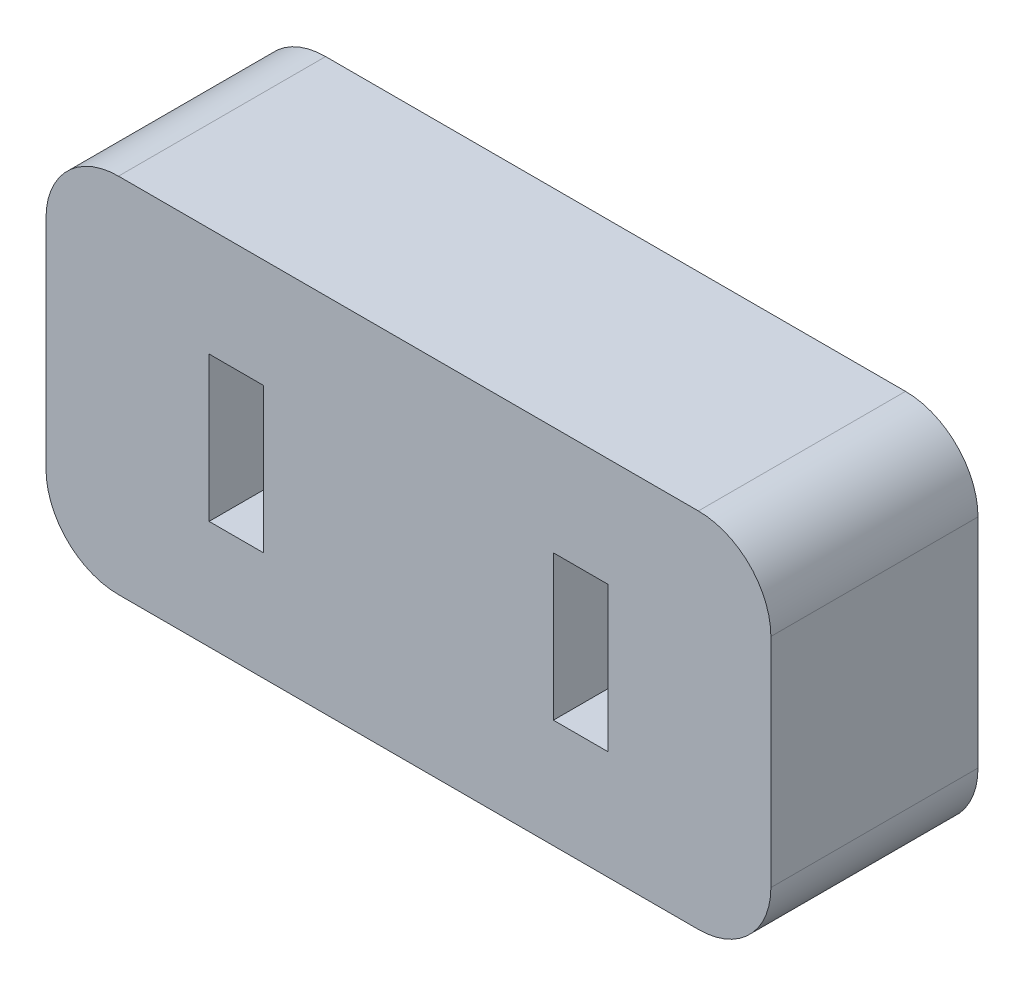
ISO-10303-21;
HEADER;
FILE_DESCRIPTION(('STEP AP214'),'2;1');
FILE_NAME('part.step','',(''),(''),'','','');
FILE_SCHEMA(('AUTOMOTIVE_DESIGN { 1 0 10303 214 1 1 1 1 }'));
ENDSEC;
DATA;
#1=APPLICATION_CONTEXT('core data for automotive mechanical design processes');
#2=APPLICATION_PROTOCOL_DEFINITION('international standard','automotive_design',2000,#1);
#3=PRODUCT_CONTEXT('',#1,'mechanical');
#4=PRODUCT('Part','Part','',(#3));
#5=PRODUCT_RELATED_PRODUCT_CATEGORY('part','',(#4));
#6=PRODUCT_DEFINITION_FORMATION('','',#4);
#7=PRODUCT_DEFINITION_CONTEXT('part definition',#1,'design');
#8=PRODUCT_DEFINITION('design','',#6,#7);
#9=PRODUCT_DEFINITION_SHAPE('','',#8);
#10=(LENGTH_UNIT() NAMED_UNIT(*) SI_UNIT(.MILLI.,.METRE.));
#11=(NAMED_UNIT(*) PLANE_ANGLE_UNIT() SI_UNIT($,.RADIAN.));
#12=(NAMED_UNIT(*) SI_UNIT($,.STERADIAN.) SOLID_ANGLE_UNIT());
#13=UNCERTAINTY_MEASURE_WITH_UNIT(LENGTH_MEASURE(1.E-05),#10,'distance_accuracy_value','');
#14=(GEOMETRIC_REPRESENTATION_CONTEXT(3) GLOBAL_UNCERTAINTY_ASSIGNED_CONTEXT((#13)) GLOBAL_UNIT_ASSIGNED_CONTEXT((#10,
#11,#12)) REPRESENTATION_CONTEXT('',''));
#15=CARTESIAN_POINT('',(0.,0.,0.));
#16=DIRECTION('',(0.,0.,1.));
#17=DIRECTION('',(1.,0.,0.));
#18=AXIS2_PLACEMENT_3D('',#15,#16,#17);
#19=CARTESIAN_POINT('',(-8.,-3.,0.));
#20=DIRECTION('',(0.,0.,1.));
#21=DIRECTION('',(1.,0.,0.));
#22=AXIS2_PLACEMENT_3D('',#19,#20,#21);
#23=CYLINDRICAL_SURFACE('',#22,2.);
#24=CARTESIAN_POINT('',(-8.,-3.,5.715));
#25=DIRECTION('',(0.,0.,-1.));
#26=DIRECTION('',(0.,-1.,0.));
#27=AXIS2_PLACEMENT_3D('',#24,#25,#26);
#28=CIRCLE('',#27,2.);
#29=CARTESIAN_POINT('',(-8.,-5.,5.715));
#30=VERTEX_POINT('',#29);
#31=CARTESIAN_POINT('',(-10.,-3.,5.715));
#32=VERTEX_POINT('',#31);
#33=EDGE_CURVE('E11',#30,#32,#28,.T.);
#34=ORIENTED_EDGE('',*,*,#33,.T.);
#35=DIRECTION('',(0.,0.,-1.));
#36=VECTOR('',#35,1.);
#37=CARTESIAN_POINT('',(-10.,-3.,0.));
#38=LINE('',#37,#36);
#39=CARTESIAN_POINT('',(-10.,-3.,0.));
#40=VERTEX_POINT('',#39);
#41=EDGE_CURVE('E26',#32,#40,#38,.T.);
#42=ORIENTED_EDGE('',*,*,#41,.T.);
#43=CARTESIAN_POINT('',(-8.,-3.,0.));
#44=DIRECTION('',(0.,0.,1.));
#45=DIRECTION('',(1.,0.,0.));
#46=AXIS2_PLACEMENT_3D('',#43,#44,#45);
#47=CIRCLE('',#46,2.);
#48=CARTESIAN_POINT('',(-8.,-5.,0.));
#49=VERTEX_POINT('',#48);
#50=EDGE_CURVE('E249',#40,#49,#47,.T.);
#51=ORIENTED_EDGE('',*,*,#50,.T.);
#52=DIRECTION('',(0.,0.,1.));
#53=VECTOR('',#52,1.);
#54=CARTESIAN_POINT('',(-8.,-5.,0.));
#55=LINE('',#54,#53);
#56=EDGE_CURVE('E242',#49,#30,#55,.T.);
#57=ORIENTED_EDGE('',*,*,#56,.T.);
#58=EDGE_LOOP('',(#34,#42,#51,#57));
#59=FACE_BOUND('',#58,.T.);
#60=ADVANCED_FACE('F16',(#59),#23,.T.);
#61=CARTESIAN_POINT('',(-10.,-5.,0.));
#62=DIRECTION('',(0.,-1.,0.));
#63=DIRECTION('',(0.,0.,-1.));
#64=AXIS2_PLACEMENT_3D('',#61,#62,#63);
#65=PLANE('',#64);
#66=ORIENTED_EDGE('',*,*,#56,.F.);
#67=DIRECTION('',(-1.,0.,0.));
#68=VECTOR('',#67,1.);
#69=CARTESIAN_POINT('',(10.,-5.,0.));
#70=LINE('',#69,#68);
#71=CARTESIAN_POINT('',(8.,-5.,0.));
#72=VERTEX_POINT('',#71);
#73=EDGE_CURVE('E209',#72,#49,#70,.T.);
#74=ORIENTED_EDGE('',*,*,#73,.F.);
#75=DIRECTION('',(0.,0.,-1.));
#76=VECTOR('',#75,1.);
#77=CARTESIAN_POINT('',(8.,-5.,0.));
#78=LINE('',#77,#76);
#79=CARTESIAN_POINT('',(8.,-5.,5.715));
#80=VERTEX_POINT('',#79);
#81=EDGE_CURVE('E210',#80,#72,#78,.T.);
#82=ORIENTED_EDGE('',*,*,#81,.F.);
#83=DIRECTION('',(1.,0.,0.));
#84=VECTOR('',#83,1.);
#85=CARTESIAN_POINT('',(10.,-5.,5.715));
#86=LINE('',#85,#84);
#87=EDGE_CURVE('E156',#30,#80,#86,.T.);
#88=ORIENTED_EDGE('',*,*,#87,.F.);
#89=EDGE_LOOP('',(#66,#74,#82,#88));
#90=FACE_BOUND('',#89,.T.);
#91=ADVANCED_FACE('F264',(#90),#65,.T.);
#92=CARTESIAN_POINT('',(0.,0.,0.));
#93=DIRECTION('',(0.,0.,1.));
#94=DIRECTION('',(1.,0.,0.));
#95=AXIS2_PLACEMENT_3D('',#92,#93,#94);
#96=PLANE('',#95);
#97=DIRECTION('',(-1.,0.,0.));
#98=VECTOR('',#97,1.);
#99=CARTESIAN_POINT('',(-2.,2.,0.));
#100=LINE('',#99,#98);
#101=CARTESIAN_POINT('',(-4.,2.,0.));
#102=VERTEX_POINT('',#101);
#103=CARTESIAN_POINT('',(-5.5,2.,0.));
#104=VERTEX_POINT('',#103);
#105=EDGE_CURVE('E239',#102,#104,#100,.T.);
#106=ORIENTED_EDGE('',*,*,#105,.T.);
#107=DIRECTION('',(0.,-1.,0.));
#108=VECTOR('',#107,1.);
#109=CARTESIAN_POINT('',(-5.5,1.,0.));
#110=LINE('',#109,#108);
#111=CARTESIAN_POINT('',(-5.5,-2.,0.));
#112=VERTEX_POINT('',#111);
#113=EDGE_CURVE('E236',#104,#112,#110,.T.);
#114=ORIENTED_EDGE('',*,*,#113,.T.);
#115=DIRECTION('',(1.,0.,0.));
#116=VECTOR('',#115,1.);
#117=CARTESIAN_POINT('',(-2.75,-2.,0.));
#118=LINE('',#117,#116);
#119=CARTESIAN_POINT('',(-4.,-2.,0.));
#120=VERTEX_POINT('',#119);
#121=EDGE_CURVE('E233',#112,#120,#118,.T.);
#122=ORIENTED_EDGE('',*,*,#121,.T.);
#123=DIRECTION('',(0.,1.,0.));
#124=VECTOR('',#123,1.);
#125=CARTESIAN_POINT('',(-4.,-1.,0.));
#126=LINE('',#125,#124);
#127=EDGE_CURVE('E231',#120,#102,#126,.T.);
#128=ORIENTED_EDGE('',*,*,#127,.T.);
#129=EDGE_LOOP('',(#106,#114,#122,#128));
#130=FACE_BOUND('',#129,.T.);
#131=DIRECTION('',(-1.,0.,0.));
#132=VECTOR('',#131,1.);
#133=CARTESIAN_POINT('',(2.75,2.,0.));
#134=LINE('',#133,#132);
#135=CARTESIAN_POINT('',(5.5,2.,0.));
#136=VERTEX_POINT('',#135);
#137=CARTESIAN_POINT('',(4.,2.,0.));
#138=VERTEX_POINT('',#137);
#139=EDGE_CURVE('E228',#136,#138,#134,.T.);
#140=ORIENTED_EDGE('',*,*,#139,.T.);
#141=DIRECTION('',(0.,-1.,0.));
#142=VECTOR('',#141,1.);
#143=CARTESIAN_POINT('',(4.,0.,0.));
#144=LINE('',#143,#142);
#145=CARTESIAN_POINT('',(4.,-2.,0.));
#146=VERTEX_POINT('',#145);
#147=EDGE_CURVE('E226',#138,#146,#144,.T.);
#148=ORIENTED_EDGE('',*,*,#147,.T.);
#149=DIRECTION('',(1.,0.,0.));
#150=VECTOR('',#149,1.);
#151=CARTESIAN_POINT('',(2.,-2.,0.));
#152=LINE('',#151,#150);
#153=CARTESIAN_POINT('',(5.5,-2.,0.));
#154=VERTEX_POINT('',#153);
#155=EDGE_CURVE('E141',#146,#154,#152,.T.);
#156=ORIENTED_EDGE('',*,*,#155,.T.);
#157=DIRECTION('',(0.,1.,0.));
#158=VECTOR('',#157,1.);
#159=CARTESIAN_POINT('',(5.5,-1.,0.));
#160=LINE('',#159,#158);
#161=EDGE_CURVE('E223',#154,#136,#160,.T.);
#162=ORIENTED_EDGE('',*,*,#161,.T.);
#163=EDGE_LOOP('',(#140,#148,#156,#162));
#164=FACE_BOUND('',#163,.T.);
#165=ORIENTED_EDGE('',*,*,#50,.F.);
#166=DIRECTION('',(0.,1.,0.));
#167=VECTOR('',#166,1.);
#168=CARTESIAN_POINT('',(-10.,-5.,0.));
#169=LINE('',#168,#167);
#170=CARTESIAN_POINT('',(-10.,3.,0.));
#171=VERTEX_POINT('',#170);
#172=EDGE_CURVE('E219',#40,#171,#169,.T.);
#173=ORIENTED_EDGE('',*,*,#172,.T.);
#174=CARTESIAN_POINT('',(-8.,3.,0.));
#175=DIRECTION('',(0.,0.,1.));
#176=DIRECTION('',(1.,0.,0.));
#177=AXIS2_PLACEMENT_3D('',#174,#175,#176);
#178=CIRCLE('',#177,2.);
#179=CARTESIAN_POINT('',(-8.,5.,0.));
#180=VERTEX_POINT('',#179);
#181=EDGE_CURVE('E183',#180,#171,#178,.T.);
#182=ORIENTED_EDGE('',*,*,#181,.F.);
#183=DIRECTION('',(1.,0.,0.));
#184=VECTOR('',#183,1.);
#185=CARTESIAN_POINT('',(-10.,5.,0.));
#186=LINE('',#185,#184);
#187=CARTESIAN_POINT('',(8.,5.,0.));
#188=VERTEX_POINT('',#187);
#189=EDGE_CURVE('E215',#180,#188,#186,.T.);
#190=ORIENTED_EDGE('',*,*,#189,.T.);
#191=CARTESIAN_POINT('',(8.,3.,0.));
#192=DIRECTION('',(0.,0.,1.));
#193=DIRECTION('',(1.,0.,0.));
#194=AXIS2_PLACEMENT_3D('',#191,#192,#193);
#195=CIRCLE('',#194,2.);
#196=CARTESIAN_POINT('',(10.,3.,0.));
#197=VERTEX_POINT('',#196);
#198=EDGE_CURVE('E195',#197,#188,#195,.T.);
#199=ORIENTED_EDGE('',*,*,#198,.F.);
#200=DIRECTION('',(0.,-1.,0.));
#201=VECTOR('',#200,1.);
#202=CARTESIAN_POINT('',(10.,5.,0.));
#203=LINE('',#202,#201);
#204=CARTESIAN_POINT('',(10.,-3.,0.));
#205=VERTEX_POINT('',#204);
#206=EDGE_CURVE('E212',#197,#205,#203,.T.);
#207=ORIENTED_EDGE('',*,*,#206,.T.);
#208=CARTESIAN_POINT('',(8.,-3.,0.));
#209=DIRECTION('',(0.,0.,1.));
#210=DIRECTION('',(1.,0.,0.));
#211=AXIS2_PLACEMENT_3D('',#208,#209,#210);
#212=CIRCLE('',#211,2.);
#213=EDGE_CURVE('E205',#72,#205,#212,.T.);
#214=ORIENTED_EDGE('',*,*,#213,.F.);
#215=ORIENTED_EDGE('',*,*,#73,.T.);
#216=EDGE_LOOP('',(#165,#173,#182,#190,#199,#207,#214,#215));
#217=FACE_BOUND('',#216,.T.);
#218=ADVANCED_FACE('F258',(#130,#164,#217),#96,.F.);
#219=CARTESIAN_POINT('',(8.,-3.,0.));
#220=DIRECTION('',(0.,0.,1.));
#221=DIRECTION('',(1.,0.,0.));
#222=AXIS2_PLACEMENT_3D('',#219,#220,#221);
#223=CYLINDRICAL_SURFACE('',#222,2.);
#224=CARTESIAN_POINT('',(8.,-3.,5.715));
#225=DIRECTION('',(0.,0.,-1.));
#226=DIRECTION('',(0.,-1.,0.));
#227=AXIS2_PLACEMENT_3D('',#224,#225,#226);
#228=CIRCLE('',#227,2.);
#229=CARTESIAN_POINT('',(10.,-3.,5.715));
#230=VERTEX_POINT('',#229);
#231=EDGE_CURVE('E206',#230,#80,#228,.T.);
#232=ORIENTED_EDGE('',*,*,#231,.T.);
#233=ORIENTED_EDGE('',*,*,#81,.T.);
#234=ORIENTED_EDGE('',*,*,#213,.T.);
#235=DIRECTION('',(0.,0.,1.));
#236=VECTOR('',#235,1.);
#237=CARTESIAN_POINT('',(10.,-3.,0.));
#238=LINE('',#237,#236);
#239=EDGE_CURVE('E199',#205,#230,#238,.T.);
#240=ORIENTED_EDGE('',*,*,#239,.T.);
#241=EDGE_LOOP('',(#232,#233,#234,#240));
#242=FACE_BOUND('',#241,.T.);
#243=ADVANCED_FACE('F286',(#242),#223,.T.);
#244=CARTESIAN_POINT('',(10.,-5.,0.));
#245=DIRECTION('',(1.,0.,0.));
#246=DIRECTION('',(0.,0.,-1.));
#247=AXIS2_PLACEMENT_3D('',#244,#245,#246);
#248=PLANE('',#247);
#249=ORIENTED_EDGE('',*,*,#239,.F.);
#250=ORIENTED_EDGE('',*,*,#206,.F.);
#251=DIRECTION('',(0.,0.,-1.));
#252=VECTOR('',#251,1.);
#253=CARTESIAN_POINT('',(10.,3.,0.));
#254=LINE('',#253,#252);
#255=CARTESIAN_POINT('',(10.,3.,5.715));
#256=VERTEX_POINT('',#255);
#257=EDGE_CURVE('E200',#256,#197,#254,.T.);
#258=ORIENTED_EDGE('',*,*,#257,.F.);
#259=DIRECTION('',(0.,1.,0.));
#260=VECTOR('',#259,1.);
#261=CARTESIAN_POINT('',(10.,5.,5.715));
#262=LINE('',#261,#260);
#263=EDGE_CURVE('E191',#230,#256,#262,.T.);
#264=ORIENTED_EDGE('',*,*,#263,.F.);
#265=EDGE_LOOP('',(#249,#250,#258,#264));
#266=FACE_BOUND('',#265,.T.);
#267=ADVANCED_FACE('F282',(#266),#248,.T.);
#268=CARTESIAN_POINT('',(8.,3.,0.));
#269=DIRECTION('',(0.,0.,1.));
#270=DIRECTION('',(1.,0.,0.));
#271=AXIS2_PLACEMENT_3D('',#268,#269,#270);
#272=CYLINDRICAL_SURFACE('',#271,2.);
#273=CARTESIAN_POINT('',(8.,3.,5.715));
#274=DIRECTION('',(0.,0.,-1.));
#275=DIRECTION('',(0.,-1.,0.));
#276=AXIS2_PLACEMENT_3D('',#273,#274,#275);
#277=CIRCLE('',#276,2.);
#278=CARTESIAN_POINT('',(8.,5.,5.715));
#279=VERTEX_POINT('',#278);
#280=EDGE_CURVE('E196',#279,#256,#277,.T.);
#281=ORIENTED_EDGE('',*,*,#280,.T.);
#282=ORIENTED_EDGE('',*,*,#257,.T.);
#283=ORIENTED_EDGE('',*,*,#198,.T.);
#284=DIRECTION('',(0.,0.,1.));
#285=VECTOR('',#284,1.);
#286=CARTESIAN_POINT('',(8.,5.,0.));
#287=LINE('',#286,#285);
#288=EDGE_CURVE('E187',#188,#279,#287,.T.);
#289=ORIENTED_EDGE('',*,*,#288,.T.);
#290=EDGE_LOOP('',(#281,#282,#283,#289));
#291=FACE_BOUND('',#290,.T.);
#292=ADVANCED_FACE('F284',(#291),#272,.T.);
#293=CARTESIAN_POINT('',(10.,5.,0.));
#294=DIRECTION('',(0.,1.,0.));
#295=DIRECTION('',(0.,0.,1.));
#296=AXIS2_PLACEMENT_3D('',#293,#294,#295);
#297=PLANE('',#296);
#298=ORIENTED_EDGE('',*,*,#288,.F.);
#299=ORIENTED_EDGE('',*,*,#189,.F.);
#300=DIRECTION('',(0.,0.,-1.));
#301=VECTOR('',#300,1.);
#302=CARTESIAN_POINT('',(-8.,5.,0.));
#303=LINE('',#302,#301);
#304=CARTESIAN_POINT('',(-8.,5.,5.715));
#305=VERTEX_POINT('',#304);
#306=EDGE_CURVE('E188',#305,#180,#303,.T.);
#307=ORIENTED_EDGE('',*,*,#306,.F.);
#308=DIRECTION('',(-1.,0.,0.));
#309=VECTOR('',#308,1.);
#310=CARTESIAN_POINT('',(-10.,5.,5.715));
#311=LINE('',#310,#309);
#312=EDGE_CURVE('E189',#279,#305,#311,.T.);
#313=ORIENTED_EDGE('',*,*,#312,.F.);
#314=EDGE_LOOP('',(#298,#299,#307,#313));
#315=FACE_BOUND('',#314,.T.);
#316=ADVANCED_FACE('F276',(#315),#297,.T.);
#317=CARTESIAN_POINT('',(-8.,3.,0.));
#318=DIRECTION('',(0.,0.,1.));
#319=DIRECTION('',(1.,0.,0.));
#320=AXIS2_PLACEMENT_3D('',#317,#318,#319);
#321=CYLINDRICAL_SURFACE('',#320,2.);
#322=CARTESIAN_POINT('',(-8.,3.,5.715));
#323=DIRECTION('',(0.,0.,-1.));
#324=DIRECTION('',(0.,-1.,0.));
#325=AXIS2_PLACEMENT_3D('',#322,#323,#324);
#326=CIRCLE('',#325,2.);
#327=CARTESIAN_POINT('',(-10.,3.,5.715));
#328=VERTEX_POINT('',#327);
#329=EDGE_CURVE('E184',#328,#305,#326,.T.);
#330=ORIENTED_EDGE('',*,*,#329,.T.);
#331=ORIENTED_EDGE('',*,*,#306,.T.);
#332=ORIENTED_EDGE('',*,*,#181,.T.);
#333=DIRECTION('',(0.,0.,1.));
#334=VECTOR('',#333,1.);
#335=CARTESIAN_POINT('',(-10.,3.,0.));
#336=LINE('',#335,#334);
#337=EDGE_CURVE('E181',#171,#328,#336,.T.);
#338=ORIENTED_EDGE('',*,*,#337,.T.);
#339=EDGE_LOOP('',(#330,#331,#332,#338));
#340=FACE_BOUND('',#339,.T.);
#341=ADVANCED_FACE('F18',(#340),#321,.T.);
#342=CARTESIAN_POINT('',(-4.,2.,0.));
#343=DIRECTION('',(0.,1.,0.));
#344=DIRECTION('',(0.,0.,1.));
#345=AXIS2_PLACEMENT_3D('',#342,#343,#344);
#346=PLANE('',#345);
#347=ORIENTED_EDGE('',*,*,#105,.F.);
#348=DIRECTION('',(0.,0.,1.));
#349=VECTOR('',#348,1.);
#350=CARTESIAN_POINT('',(-4.,2.,0.));
#351=LINE('',#350,#349);
#352=CARTESIAN_POINT('',(-4.,2.,5.715));
#353=VERTEX_POINT('',#352);
#354=EDGE_CURVE('E175',#102,#353,#351,.T.);
#355=ORIENTED_EDGE('',*,*,#354,.T.);
#356=DIRECTION('',(1.,0.,0.));
#357=VECTOR('',#356,1.);
#358=CARTESIAN_POINT('',(-2.,2.,5.715));
#359=LINE('',#358,#357);
#360=CARTESIAN_POINT('',(-5.5,2.,5.715));
#361=VERTEX_POINT('',#360);
#362=EDGE_CURVE('E172',#361,#353,#359,.T.);
#363=ORIENTED_EDGE('',*,*,#362,.F.);
#364=DIRECTION('',(0.,0.,1.));
#365=VECTOR('',#364,1.);
#366=CARTESIAN_POINT('',(-5.5,2.,0.));
#367=LINE('',#366,#365);
#368=EDGE_CURVE('E161',#104,#361,#367,.T.);
#369=ORIENTED_EDGE('',*,*,#368,.F.);
#370=EDGE_LOOP('',(#347,#355,#363,#369));
#371=FACE_BOUND('',#370,.T.);
#372=ADVANCED_FACE('F331',(#371),#346,.F.);
#373=CARTESIAN_POINT('',(-4.,-2.,0.));
#374=DIRECTION('',(1.,0.,0.));
#375=DIRECTION('',(0.,0.,-1.));
#376=AXIS2_PLACEMENT_3D('',#373,#374,#375);
#377=PLANE('',#376);
#378=ORIENTED_EDGE('',*,*,#127,.F.);
#379=DIRECTION('',(0.,0.,1.));
#380=VECTOR('',#379,1.);
#381=CARTESIAN_POINT('',(-4.,-2.,0.));
#382=LINE('',#381,#380);
#383=CARTESIAN_POINT('',(-4.,-2.,5.715));
#384=VERTEX_POINT('',#383);
#385=EDGE_CURVE('E170',#120,#384,#382,.T.);
#386=ORIENTED_EDGE('',*,*,#385,.T.);
#387=DIRECTION('',(0.,-1.,0.));
#388=VECTOR('',#387,1.);
#389=CARTESIAN_POINT('',(-4.,-1.,5.715));
#390=LINE('',#389,#388);
#391=EDGE_CURVE('E166',#353,#384,#390,.T.);
#392=ORIENTED_EDGE('',*,*,#391,.F.);
#393=ORIENTED_EDGE('',*,*,#354,.F.);
#394=EDGE_LOOP('',(#378,#386,#392,#393));
#395=FACE_BOUND('',#394,.T.);
#396=ADVANCED_FACE('F327',(#395),#377,.F.);
#397=CARTESIAN_POINT('',(-5.5,-2.,0.));
#398=DIRECTION('',(0.,-1.,0.));
#399=DIRECTION('',(0.,0.,-1.));
#400=AXIS2_PLACEMENT_3D('',#397,#398,#399);
#401=PLANE('',#400);
#402=ORIENTED_EDGE('',*,*,#121,.F.);
#403=DIRECTION('',(0.,0.,1.));
#404=VECTOR('',#403,1.);
#405=CARTESIAN_POINT('',(-5.5,-2.,0.));
#406=LINE('',#405,#404);
#407=CARTESIAN_POINT('',(-5.5,-2.,5.715));
#408=VERTEX_POINT('',#407);
#409=EDGE_CURVE('E167',#112,#408,#406,.T.);
#410=ORIENTED_EDGE('',*,*,#409,.T.);
#411=DIRECTION('',(-1.,0.,0.));
#412=VECTOR('',#411,1.);
#413=CARTESIAN_POINT('',(-2.75,-2.,5.715));
#414=LINE('',#413,#412);
#415=EDGE_CURVE('E164',#384,#408,#414,.T.);
#416=ORIENTED_EDGE('',*,*,#415,.F.);
#417=ORIENTED_EDGE('',*,*,#385,.F.);
#418=EDGE_LOOP('',(#402,#410,#416,#417));
#419=FACE_BOUND('',#418,.T.);
#420=ADVANCED_FACE('F323',(#419),#401,.F.);
#421=CARTESIAN_POINT('',(-5.5,2.,0.));
#422=DIRECTION('',(-1.,0.,0.));
#423=DIRECTION('',(0.,0.,1.));
#424=AXIS2_PLACEMENT_3D('',#421,#422,#423);
#425=PLANE('',#424);
#426=ORIENTED_EDGE('',*,*,#113,.F.);
#427=ORIENTED_EDGE('',*,*,#368,.T.);
#428=DIRECTION('',(0.,1.,0.));
#429=VECTOR('',#428,1.);
#430=CARTESIAN_POINT('',(-5.5,1.,5.715));
#431=LINE('',#430,#429);
#432=EDGE_CURVE('E158',#408,#361,#431,.T.);
#433=ORIENTED_EDGE('',*,*,#432,.F.);
#434=ORIENTED_EDGE('',*,*,#409,.F.);
#435=EDGE_LOOP('',(#426,#427,#433,#434));
#436=FACE_BOUND('',#435,.T.);
#437=ADVANCED_FACE('F319',(#436),#425,.F.);
#438=CARTESIAN_POINT('',(5.5,2.,0.));
#439=DIRECTION('',(0.,1.,0.));
#440=DIRECTION('',(0.,0.,1.));
#441=AXIS2_PLACEMENT_3D('',#438,#439,#440);
#442=PLANE('',#441);
#443=ORIENTED_EDGE('',*,*,#139,.F.);
#444=DIRECTION('',(0.,0.,1.));
#445=VECTOR('',#444,1.);
#446=CARTESIAN_POINT('',(5.5,2.,0.));
#447=LINE('',#446,#445);
#448=CARTESIAN_POINT('',(5.5,2.,5.715));
#449=VERTEX_POINT('',#448);
#450=EDGE_CURVE('E154',#136,#449,#447,.T.);
#451=ORIENTED_EDGE('',*,*,#450,.T.);
#452=DIRECTION('',(1.,0.,0.));
#453=VECTOR('',#452,1.);
#454=CARTESIAN_POINT('',(2.75,2.,5.715));
#455=LINE('',#454,#453);
#456=CARTESIAN_POINT('',(4.,2.,5.715));
#457=VERTEX_POINT('',#456);
#458=EDGE_CURVE('E152',#457,#449,#455,.T.);
#459=ORIENTED_EDGE('',*,*,#458,.F.);
#460=DIRECTION('',(0.,0.,1.));
#461=VECTOR('',#460,1.);
#462=CARTESIAN_POINT('',(4.,2.,0.));
#463=LINE('',#462,#461);
#464=EDGE_CURVE('E145',#138,#457,#463,.T.);
#465=ORIENTED_EDGE('',*,*,#464,.F.);
#466=EDGE_LOOP('',(#443,#451,#459,#465));
#467=FACE_BOUND('',#466,.T.);
#468=ADVANCED_FACE('F315',(#467),#442,.F.);
#469=CARTESIAN_POINT('',(5.5,-2.,0.));
#470=DIRECTION('',(1.,0.,0.));
#471=DIRECTION('',(0.,0.,-1.));
#472=AXIS2_PLACEMENT_3D('',#469,#470,#471);
#473=PLANE('',#472);
#474=ORIENTED_EDGE('',*,*,#161,.F.);
#475=DIRECTION('',(0.,0.,1.));
#476=VECTOR('',#475,1.);
#477=CARTESIAN_POINT('',(5.5,-2.,0.));
#478=LINE('',#477,#476);
#479=CARTESIAN_POINT('',(5.5,-2.,5.715));
#480=VERTEX_POINT('',#479);
#481=EDGE_CURVE('E144',#154,#480,#478,.T.);
#482=ORIENTED_EDGE('',*,*,#481,.T.);
#483=DIRECTION('',(0.,-1.,0.));
#484=VECTOR('',#483,1.);
#485=CARTESIAN_POINT('',(5.5,-1.,5.715));
#486=LINE('',#485,#484);
#487=EDGE_CURVE('E125',#449,#480,#486,.T.);
#488=ORIENTED_EDGE('',*,*,#487,.F.);
#489=ORIENTED_EDGE('',*,*,#450,.F.);
#490=EDGE_LOOP('',(#474,#482,#488,#489));
#491=FACE_BOUND('',#490,.T.);
#492=ADVANCED_FACE('F312',(#491),#473,.F.);
#493=CARTESIAN_POINT('',(4.,-2.,0.));
#494=DIRECTION('',(0.,-1.,0.));
#495=DIRECTION('',(0.,0.,-1.));
#496=AXIS2_PLACEMENT_3D('',#493,#494,#495);
#497=PLANE('',#496);
#498=ORIENTED_EDGE('',*,*,#155,.F.);
#499=DIRECTION('',(0.,0.,1.));
#500=VECTOR('',#499,1.);
#501=CARTESIAN_POINT('',(4.,-2.,0.));
#502=LINE('',#501,#500);
#503=CARTESIAN_POINT('',(4.,-2.,5.715));
#504=VERTEX_POINT('',#503);
#505=EDGE_CURVE('E138',#146,#504,#502,.T.);
#506=ORIENTED_EDGE('',*,*,#505,.T.);
#507=DIRECTION('',(-1.,0.,0.));
#508=VECTOR('',#507,1.);
#509=CARTESIAN_POINT('',(2.,-2.,5.715));
#510=LINE('',#509,#508);
#511=EDGE_CURVE('E129',#480,#504,#510,.T.);
#512=ORIENTED_EDGE('',*,*,#511,.F.);
#513=ORIENTED_EDGE('',*,*,#481,.F.);
#514=EDGE_LOOP('',(#498,#506,#512,#513));
#515=FACE_BOUND('',#514,.T.);
#516=ADVANCED_FACE('F139',(#515),#497,.F.);
#517=CARTESIAN_POINT('',(4.,0.,0.));
#518=DIRECTION('',(-1.,0.,0.));
#519=DIRECTION('',(0.,0.,1.));
#520=AXIS2_PLACEMENT_3D('',#517,#518,#519);
#521=PLANE('',#520);
#522=ORIENTED_EDGE('',*,*,#147,.F.);
#523=ORIENTED_EDGE('',*,*,#464,.T.);
#524=DIRECTION('',(0.,1.,0.));
#525=VECTOR('',#524,1.);
#526=CARTESIAN_POINT('',(4.,0.,5.715));
#527=LINE('',#526,#525);
#528=EDGE_CURVE('E133',#504,#457,#527,.T.);
#529=ORIENTED_EDGE('',*,*,#528,.F.);
#530=ORIENTED_EDGE('',*,*,#505,.F.);
#531=EDGE_LOOP('',(#522,#523,#529,#530));
#532=FACE_BOUND('',#531,.T.);
#533=ADVANCED_FACE('F148',(#532),#521,.F.);
#534=CARTESIAN_POINT('',(-10.,5.,0.));
#535=DIRECTION('',(-1.,0.,0.));
#536=DIRECTION('',(0.,0.,1.));
#537=AXIS2_PLACEMENT_3D('',#534,#535,#536);
#538=PLANE('',#537);
#539=ORIENTED_EDGE('',*,*,#41,.F.);
#540=DIRECTION('',(0.,-1.,0.));
#541=VECTOR('',#540,1.);
#542=CARTESIAN_POINT('',(-10.,-5.,5.715));
#543=LINE('',#542,#541);
#544=EDGE_CURVE('E20',#328,#32,#543,.T.);
#545=ORIENTED_EDGE('',*,*,#544,.F.);
#546=ORIENTED_EDGE('',*,*,#337,.F.);
#547=ORIENTED_EDGE('',*,*,#172,.F.);
#548=EDGE_LOOP('',(#539,#545,#546,#547));
#549=FACE_BOUND('',#548,.T.);
#550=ADVANCED_FACE('F256',(#549),#538,.T.);
#551=CARTESIAN_POINT('',(0.,0.,5.715));
#552=DIRECTION('',(0.,0.,1.));
#553=DIRECTION('',(1.,0.,0.));
#554=AXIS2_PLACEMENT_3D('',#551,#552,#553);
#555=PLANE('',#554);
#556=ORIENTED_EDGE('',*,*,#33,.F.);
#557=ORIENTED_EDGE('',*,*,#87,.T.);
#558=ORIENTED_EDGE('',*,*,#231,.F.);
#559=ORIENTED_EDGE('',*,*,#263,.T.);
#560=ORIENTED_EDGE('',*,*,#280,.F.);
#561=ORIENTED_EDGE('',*,*,#312,.T.);
#562=ORIENTED_EDGE('',*,*,#329,.F.);
#563=ORIENTED_EDGE('',*,*,#544,.T.);
#564=EDGE_LOOP('',(#556,#557,#558,#559,#560,#561,#562,#563));
#565=FACE_BOUND('',#564,.T.);
#566=ORIENTED_EDGE('',*,*,#362,.T.);
#567=ORIENTED_EDGE('',*,*,#391,.T.);
#568=ORIENTED_EDGE('',*,*,#415,.T.);
#569=ORIENTED_EDGE('',*,*,#432,.T.);
#570=EDGE_LOOP('',(#566,#567,#568,#569));
#571=FACE_BOUND('',#570,.T.);
#572=ORIENTED_EDGE('',*,*,#458,.T.);
#573=ORIENTED_EDGE('',*,*,#487,.T.);
#574=ORIENTED_EDGE('',*,*,#511,.T.);
#575=ORIENTED_EDGE('',*,*,#528,.T.);
#576=EDGE_LOOP('',(#572,#573,#574,#575));
#577=FACE_BOUND('',#576,.T.);
#578=ADVANCED_FACE('F131',(#565,#571,#577),#555,.T.);
#579=CLOSED_SHELL('',(#60,#91,#218,#243,#267,#292,#316,#341,#372,#396,#420,#437,#468,#492,#516,
#533,#550,#578));
#580=MANIFOLD_SOLID_BREP('B1',#579);
#581=ADVANCED_BREP_SHAPE_REPRESENTATION('',(#18,#580),#14);
#582=SHAPE_DEFINITION_REPRESENTATION(#9,#581);
ENDSEC;
END-ISO-10303-21;
